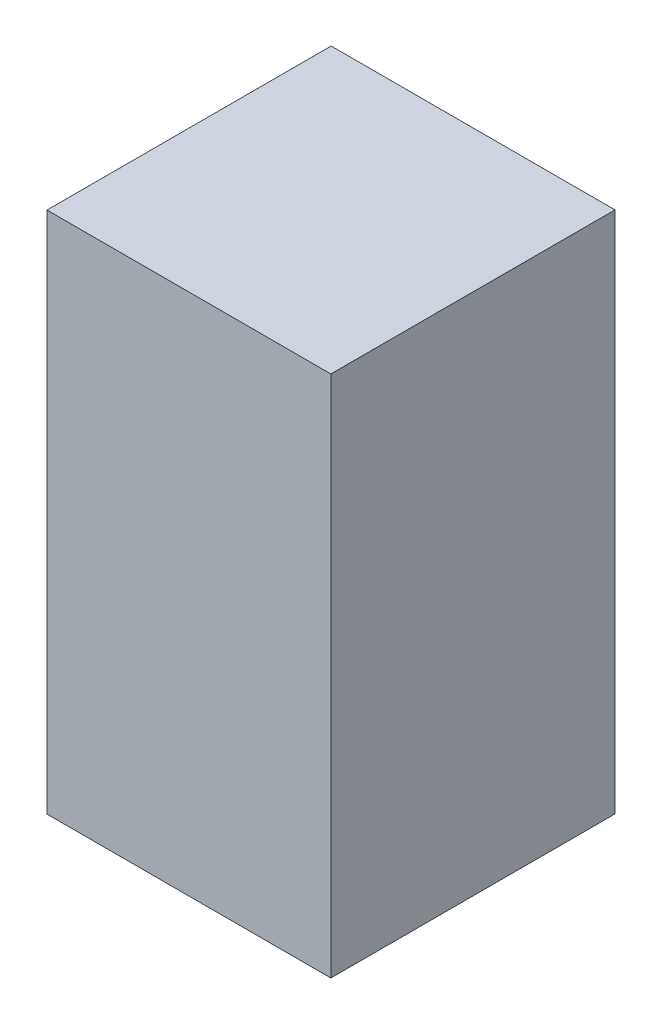
ISO-10303-21;
HEADER;
FILE_DESCRIPTION(('STEP AP214'),'2;1');
FILE_NAME('part.step','',(''),(''),'','','');
FILE_SCHEMA(('AUTOMOTIVE_DESIGN { 1 0 10303 214 1 1 1 1 }'));
ENDSEC;
DATA;
#1=APPLICATION_CONTEXT('core data for automotive mechanical design processes');
#2=APPLICATION_PROTOCOL_DEFINITION('international standard','automotive_design',2000,#1);
#3=PRODUCT_CONTEXT('',#1,'mechanical');
#4=PRODUCT('Part','Part','',(#3));
#5=PRODUCT_RELATED_PRODUCT_CATEGORY('part','',(#4));
#6=PRODUCT_DEFINITION_FORMATION('','',#4);
#7=PRODUCT_DEFINITION_CONTEXT('part definition',#1,'design');
#8=PRODUCT_DEFINITION('design','',#6,#7);
#9=PRODUCT_DEFINITION_SHAPE('','',#8);
#10=(LENGTH_UNIT() NAMED_UNIT(*) SI_UNIT(.MILLI.,.METRE.));
#11=(NAMED_UNIT(*) PLANE_ANGLE_UNIT() SI_UNIT($,.RADIAN.));
#12=(NAMED_UNIT(*) SI_UNIT($,.STERADIAN.) SOLID_ANGLE_UNIT());
#13=UNCERTAINTY_MEASURE_WITH_UNIT(LENGTH_MEASURE(1.E-05),#10,'distance_accuracy_value','');
#14=(GEOMETRIC_REPRESENTATION_CONTEXT(3) GLOBAL_UNCERTAINTY_ASSIGNED_CONTEXT((#13)) GLOBAL_UNIT_ASSIGNED_CONTEXT((#10,
#11,#12)) REPRESENTATION_CONTEXT('',''));
#15=CARTESIAN_POINT('',(0.,0.,0.));
#16=DIRECTION('',(0.,0.,1.));
#17=DIRECTION('',(1.,0.,0.));
#18=AXIS2_PLACEMENT_3D('',#15,#16,#17);
#19=CARTESIAN_POINT('',(0.47449232,-0.87449152,0.95000064));
#20=DIRECTION('',(0.,0.,1.));
#21=DIRECTION('',(1.,0.,0.));
#22=AXIS2_PLACEMENT_3D('',#19,#20,#21);
#23=PLANE('',#22);
#24=DIRECTION('',(0.,-1.,0.));
#25=VECTOR('',#24,1.);
#26=CARTESIAN_POINT('',(0.47449232,0.87449152,0.95000064));
#27=LINE('',#26,#25);
#28=CARTESIAN_POINT('',(0.47449232,0.87449152,0.95000064));
#29=VERTEX_POINT('',#28);
#30=CARTESIAN_POINT('',(0.47449232,-0.87449152,0.95000064));
#31=VERTEX_POINT('',#30);
#32=EDGE_CURVE('E26',#29,#31,#27,.T.);
#33=ORIENTED_EDGE('',*,*,#32,.F.);
#34=DIRECTION('',(1.,0.,0.));
#35=VECTOR('',#34,1.);
#36=CARTESIAN_POINT('',(-0.47449232,0.87449152,0.95000064));
#37=LINE('',#36,#35);
#38=CARTESIAN_POINT('',(-0.47449232,0.87449152,0.95000064));
#39=VERTEX_POINT('',#38);
#40=EDGE_CURVE('E83',#39,#29,#37,.T.);
#41=ORIENTED_EDGE('',*,*,#40,.F.);
#42=DIRECTION('',(0.,1.,0.));
#43=VECTOR('',#42,1.);
#44=CARTESIAN_POINT('',(-0.47449232,-0.87449152,0.95000064));
#45=LINE('',#44,#43);
#46=CARTESIAN_POINT('',(-0.47449232,-0.87449152,0.95000064));
#47=VERTEX_POINT('',#46);
#48=EDGE_CURVE('E91',#47,#39,#45,.T.);
#49=ORIENTED_EDGE('',*,*,#48,.F.);
#50=DIRECTION('',(-1.,0.,0.));
#51=VECTOR('',#50,1.);
#52=CARTESIAN_POINT('',(0.47449232,-0.87449152,0.95000064));
#53=LINE('',#52,#51);
#54=EDGE_CURVE('E94',#31,#47,#53,.T.);
#55=ORIENTED_EDGE('',*,*,#54,.F.);
#56=EDGE_LOOP('',(#33,#41,#49,#55));
#57=FACE_BOUND('',#56,.T.);
#58=ADVANCED_FACE('F17',(#57),#23,.T.);
#59=CARTESIAN_POINT('',(0.47449232,-0.87449152,0.));
#60=DIRECTION('',(0.,0.,1.));
#61=DIRECTION('',(1.,0.,0.));
#62=AXIS2_PLACEMENT_3D('',#59,#60,#61);
#63=PLANE('',#62);
#64=DIRECTION('',(-1.,0.,0.));
#65=VECTOR('',#64,1.);
#66=CARTESIAN_POINT('',(0.47449232,-0.87449152,0.));
#67=LINE('',#66,#65);
#68=CARTESIAN_POINT('',(0.47449232,-0.87449152,0.));
#69=VERTEX_POINT('',#68);
#70=CARTESIAN_POINT('',(-0.47449232,-0.87449152,0.));
#71=VERTEX_POINT('',#70);
#72=EDGE_CURVE('E86',#69,#71,#67,.T.);
#73=ORIENTED_EDGE('',*,*,#72,.T.);
#74=DIRECTION('',(0.,1.,0.));
#75=VECTOR('',#74,1.);
#76=CARTESIAN_POINT('',(-0.47449232,-0.87449152,0.));
#77=LINE('',#76,#75);
#78=CARTESIAN_POINT('',(-0.47449232,0.87449152,0.));
#79=VERTEX_POINT('',#78);
#80=EDGE_CURVE('E72',#71,#79,#77,.T.);
#81=ORIENTED_EDGE('',*,*,#80,.T.);
#82=DIRECTION('',(1.,0.,0.));
#83=VECTOR('',#82,1.);
#84=CARTESIAN_POINT('',(-0.47449232,0.87449152,0.));
#85=LINE('',#84,#83);
#86=CARTESIAN_POINT('',(0.47449232,0.87449152,0.));
#87=VERTEX_POINT('',#86);
#88=EDGE_CURVE('E20',#79,#87,#85,.T.);
#89=ORIENTED_EDGE('',*,*,#88,.T.);
#90=DIRECTION('',(0.,-1.,0.));
#91=VECTOR('',#90,1.);
#92=CARTESIAN_POINT('',(0.47449232,0.87449152,0.));
#93=LINE('',#92,#91);
#94=EDGE_CURVE('E11',#87,#69,#93,.T.);
#95=ORIENTED_EDGE('',*,*,#94,.T.);
#96=EDGE_LOOP('',(#73,#81,#89,#95));
#97=FACE_BOUND('',#96,.T.);
#98=ADVANCED_FACE('F87',(#97),#63,.F.);
#99=CARTESIAN_POINT('',(0.47449232,0.87449152,0.));
#100=DIRECTION('',(1.,0.,0.));
#101=DIRECTION('',(0.,1.,0.));
#102=AXIS2_PLACEMENT_3D('',#99,#100,#101);
#103=PLANE('',#102);
#104=DIRECTION('',(0.,0.,1.));
#105=VECTOR('',#104,1.);
#106=CARTESIAN_POINT('',(0.47449232,0.87449152,0.));
#107=LINE('',#106,#105);
#108=EDGE_CURVE('E107',#87,#29,#107,.T.);
#109=ORIENTED_EDGE('',*,*,#108,.T.);
#110=ORIENTED_EDGE('',*,*,#32,.T.);
#111=DIRECTION('',(0.,0.,1.));
#112=VECTOR('',#111,1.);
#113=CARTESIAN_POINT('',(0.47449232,-0.87449152,0.));
#114=LINE('',#113,#112);
#115=EDGE_CURVE('E101',#69,#31,#114,.T.);
#116=ORIENTED_EDGE('',*,*,#115,.F.);
#117=ORIENTED_EDGE('',*,*,#94,.F.);
#118=EDGE_LOOP('',(#109,#110,#116,#117));
#119=FACE_BOUND('',#118,.T.);
#120=ADVANCED_FACE('F170',(#119),#103,.T.);
#121=CARTESIAN_POINT('',(-0.47449232,0.87449152,0.));
#122=DIRECTION('',(0.,1.,0.));
#123=DIRECTION('',(1.,0.,0.));
#124=AXIS2_PLACEMENT_3D('',#121,#122,#123);
#125=PLANE('',#124);
#126=DIRECTION('',(0.,0.,1.));
#127=VECTOR('',#126,1.);
#128=CARTESIAN_POINT('',(-0.47449232,0.87449152,0.));
#129=LINE('',#128,#127);
#130=EDGE_CURVE('E80',#79,#39,#129,.T.);
#131=ORIENTED_EDGE('',*,*,#130,.T.);
#132=ORIENTED_EDGE('',*,*,#40,.T.);
#133=ORIENTED_EDGE('',*,*,#108,.F.);
#134=ORIENTED_EDGE('',*,*,#88,.F.);
#135=EDGE_LOOP('',(#131,#132,#133,#134));
#136=FACE_BOUND('',#135,.T.);
#137=ADVANCED_FACE('F122',(#136),#125,.T.);
#138=CARTESIAN_POINT('',(-0.47449232,-0.87449152,0.));
#139=DIRECTION('',(-1.,0.,0.));
#140=DIRECTION('',(0.,0.,1.));
#141=AXIS2_PLACEMENT_3D('',#138,#139,#140);
#142=PLANE('',#141);
#143=DIRECTION('',(0.,0.,1.));
#144=VECTOR('',#143,1.);
#145=CARTESIAN_POINT('',(-0.47449232,-0.87449152,0.));
#146=LINE('',#145,#144);
#147=EDGE_CURVE('E77',#71,#47,#146,.T.);
#148=ORIENTED_EDGE('',*,*,#147,.T.);
#149=ORIENTED_EDGE('',*,*,#48,.T.);
#150=ORIENTED_EDGE('',*,*,#130,.F.);
#151=ORIENTED_EDGE('',*,*,#80,.F.);
#152=EDGE_LOOP('',(#148,#149,#150,#151));
#153=FACE_BOUND('',#152,.T.);
#154=ADVANCED_FACE('F74',(#153),#142,.T.);
#155=CARTESIAN_POINT('',(0.47449232,-0.87449152,0.));
#156=DIRECTION('',(0.,-1.,0.));
#157=DIRECTION('',(0.,0.,-1.));
#158=AXIS2_PLACEMENT_3D('',#155,#156,#157);
#159=PLANE('',#158);
#160=ORIENTED_EDGE('',*,*,#115,.T.);
#161=ORIENTED_EDGE('',*,*,#54,.T.);
#162=ORIENTED_EDGE('',*,*,#147,.F.);
#163=ORIENTED_EDGE('',*,*,#72,.F.);
#164=EDGE_LOOP('',(#160,#161,#162,#163));
#165=FACE_BOUND('',#164,.T.);
#166=ADVANCED_FACE('F93',(#165),#159,.T.);
#167=CLOSED_SHELL('',(#58,#98,#120,#137,#154,#166));
#168=MANIFOLD_SOLID_BREP('B1',#167);
#169=ADVANCED_BREP_SHAPE_REPRESENTATION('',(#18,#168),#14);
#170=SHAPE_DEFINITION_REPRESENTATION(#9,#169);
ENDSEC;
END-ISO-10303-21;
